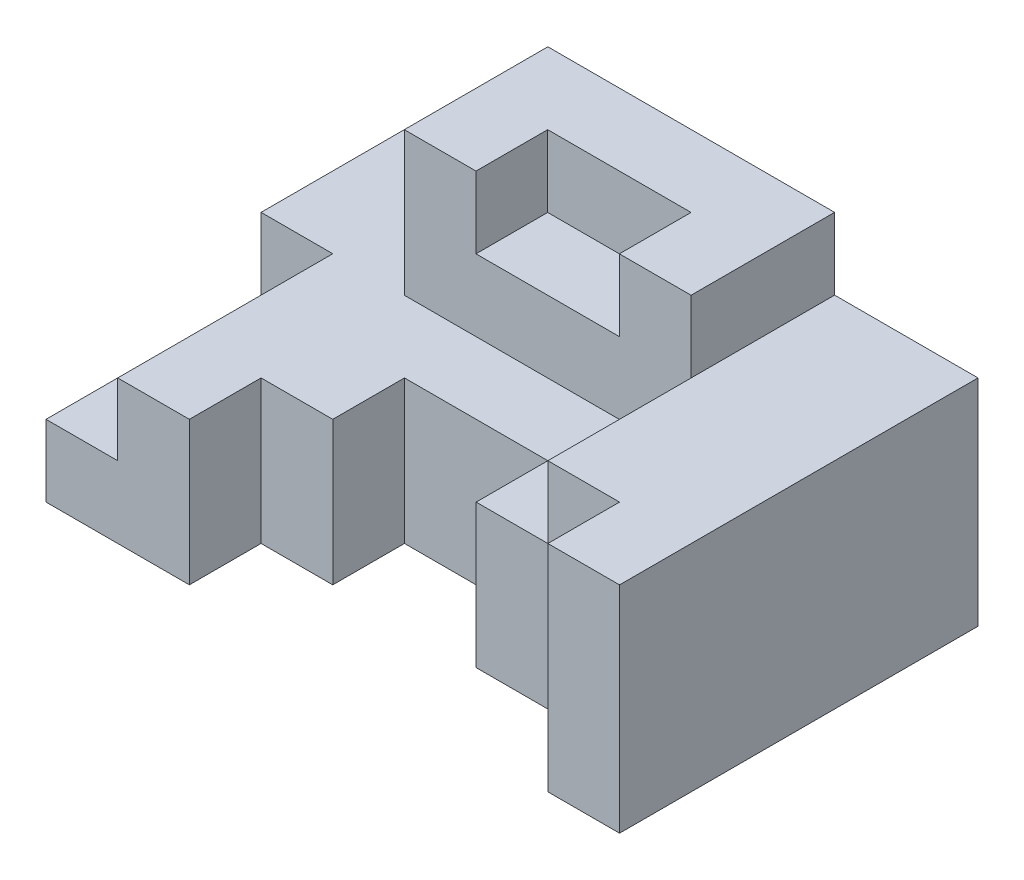
ISO-10303-21;
HEADER;
FILE_DESCRIPTION(('STEP AP214'),'2;1');
FILE_NAME('part.step','',(''),(''),'','','');
FILE_SCHEMA(('AUTOMOTIVE_DESIGN { 1 0 10303 214 1 1 1 1 }'));
ENDSEC;
DATA;
#1=APPLICATION_CONTEXT('core data for automotive mechanical design processes');
#2=APPLICATION_PROTOCOL_DEFINITION('international standard','automotive_design',2000,#1);
#3=PRODUCT_CONTEXT('',#1,'mechanical');
#4=PRODUCT('Part','Part','',(#3));
#5=PRODUCT_RELATED_PRODUCT_CATEGORY('part','',(#4));
#6=PRODUCT_DEFINITION_FORMATION('','',#4);
#7=PRODUCT_DEFINITION_CONTEXT('part definition',#1,'design');
#8=PRODUCT_DEFINITION('design','',#6,#7);
#9=PRODUCT_DEFINITION_SHAPE('','',#8);
#10=(LENGTH_UNIT() NAMED_UNIT(*) SI_UNIT(.MILLI.,.METRE.));
#11=(NAMED_UNIT(*) PLANE_ANGLE_UNIT() SI_UNIT($,.RADIAN.));
#12=(NAMED_UNIT(*) SI_UNIT($,.STERADIAN.) SOLID_ANGLE_UNIT());
#13=UNCERTAINTY_MEASURE_WITH_UNIT(LENGTH_MEASURE(1.E-05),#10,'distance_accuracy_value','');
#14=(GEOMETRIC_REPRESENTATION_CONTEXT(3) GLOBAL_UNCERTAINTY_ASSIGNED_CONTEXT((#13)) GLOBAL_UNIT_ASSIGNED_CONTEXT((#10,
#11,#12)) REPRESENTATION_CONTEXT('',''));
#15=CARTESIAN_POINT('',(0.,0.,0.));
#16=DIRECTION('',(0.,0.,1.));
#17=DIRECTION('',(1.,0.,0.));
#18=AXIS2_PLACEMENT_3D('',#15,#16,#17);
#19=CARTESIAN_POINT('',(0.,20.,0.));
#20=DIRECTION('',(0.,-1.,0.));
#21=DIRECTION('',(0.,0.,-1.));
#22=AXIS2_PLACEMENT_3D('',#19,#20,#21);
#23=PLANE('',#22);
#24=DIRECTION('',(0.,0.,1.));
#25=VECTOR('',#24,1.);
#26=CARTESIAN_POINT('',(-20.,20.,-25.));
#27=LINE('',#26,#25);
#28=CARTESIAN_POINT('',(-20.,20.,-25.));
#29=VERTEX_POINT('',#28);
#30=CARTESIAN_POINT('',(-20.,20.,-4.97728243811934));
#31=VERTEX_POINT('',#30);
#32=EDGE_CURVE('E237',#29,#31,#27,.T.);
#33=ORIENTED_EDGE('',*,*,#32,.F.);
#34=DIRECTION('',(-1.,0.,0.));
#35=VECTOR('',#34,1.);
#36=CARTESIAN_POINT('',(-40.,20.,-25.));
#37=LINE('',#36,#35);
#38=CARTESIAN_POINT('',(-40.,20.,-25.));
#39=VERTEX_POINT('',#38);
#40=EDGE_CURVE('E37',#29,#39,#37,.T.);
#41=ORIENTED_EDGE('',*,*,#40,.T.);
#42=DIRECTION('',(0.,0.,1.));
#43=VECTOR('',#42,1.);
#44=CARTESIAN_POINT('',(-40.,20.,25.));
#45=LINE('',#44,#43);
#46=CARTESIAN_POINT('',(-40.,20.,-4.99999999999999));
#47=VERTEX_POINT('',#46);
#48=EDGE_CURVE('E340',#39,#47,#45,.T.);
#49=ORIENTED_EDGE('',*,*,#48,.T.);
#50=DIRECTION('',(-1.,0.,0.));
#51=VECTOR('',#50,1.);
#52=CARTESIAN_POINT('',(-40.,20.,-4.99999999999999));
#53=LINE('',#52,#51);
#54=CARTESIAN_POINT('',(-30.,20.,-4.99999999999999));
#55=VERTEX_POINT('',#54);
#56=EDGE_CURVE('E387',#55,#47,#53,.T.);
#57=ORIENTED_EDGE('',*,*,#56,.F.);
#58=DIRECTION('',(0.,0.,-1.));
#59=VECTOR('',#58,1.);
#60=CARTESIAN_POINT('',(-30.,20.,25.));
#61=LINE('',#60,#59);
#62=CARTESIAN_POINT('',(-30.,20.,25.));
#63=VERTEX_POINT('',#62);
#64=EDGE_CURVE('E294',#63,#55,#61,.T.);
#65=ORIENTED_EDGE('',*,*,#64,.F.);
#66=DIRECTION('',(1.,0.,0.));
#67=VECTOR('',#66,1.);
#68=CARTESIAN_POINT('',(-40.,20.,25.));
#69=LINE('',#68,#67);
#70=CARTESIAN_POINT('',(-20.,20.,25.));
#71=VERTEX_POINT('',#70);
#72=EDGE_CURVE('E343',#63,#71,#69,.T.);
#73=ORIENTED_EDGE('',*,*,#72,.T.);
#74=DIRECTION('',(0.,0.,1.));
#75=VECTOR('',#74,1.);
#76=CARTESIAN_POINT('',(-20.,20.,25.));
#77=LINE('',#76,#75);
#78=CARTESIAN_POINT('',(-20.,20.,15.));
#79=VERTEX_POINT('',#78);
#80=EDGE_CURVE('E316',#79,#71,#77,.T.);
#81=ORIENTED_EDGE('',*,*,#80,.F.);
#82=DIRECTION('',(-1.,0.,0.));
#83=VECTOR('',#82,1.);
#84=CARTESIAN_POINT('',(-20.,20.,15.));
#85=LINE('',#84,#83);
#86=CARTESIAN_POINT('',(-10.,20.,15.));
#87=VERTEX_POINT('',#86);
#88=EDGE_CURVE('E313',#87,#79,#85,.T.);
#89=ORIENTED_EDGE('',*,*,#88,.F.);
#90=DIRECTION('',(0.,0.,1.));
#91=VECTOR('',#90,1.);
#92=CARTESIAN_POINT('',(-10.,20.,15.));
#93=LINE('',#92,#91);
#94=CARTESIAN_POINT('',(-10.,20.,5.));
#95=VERTEX_POINT('',#94);
#96=EDGE_CURVE('E310',#95,#87,#93,.T.);
#97=ORIENTED_EDGE('',*,*,#96,.F.);
#98=DIRECTION('',(-1.,0.,0.));
#99=VECTOR('',#98,1.);
#100=CARTESIAN_POINT('',(-10.,20.,5.));
#101=LINE('',#100,#99);
#102=CARTESIAN_POINT('',(10.,20.,5.));
#103=VERTEX_POINT('',#102);
#104=EDGE_CURVE('E307',#103,#95,#101,.T.);
#105=ORIENTED_EDGE('',*,*,#104,.F.);
#106=DIRECTION('',(0.,0.,-1.));
#107=VECTOR('',#106,1.);
#108=CARTESIAN_POINT('',(10.,20.,5.));
#109=LINE('',#108,#107);
#110=CARTESIAN_POINT('',(10.,20.,15.));
#111=VERTEX_POINT('',#110);
#112=EDGE_CURVE('E297',#111,#103,#109,.T.);
#113=ORIENTED_EDGE('',*,*,#112,.F.);
#114=DIRECTION('',(-1.,0.,0.));
#115=VECTOR('',#114,1.);
#116=CARTESIAN_POINT('',(10.,20.,15.));
#117=LINE('',#116,#115);
#118=CARTESIAN_POINT('',(20.,20.,15.));
#119=VERTEX_POINT('',#118);
#120=EDGE_CURVE('E295',#119,#111,#117,.T.);
#121=ORIENTED_EDGE('',*,*,#120,.F.);
#122=DIRECTION('',(0.,0.,1.));
#123=VECTOR('',#122,1.);
#124=CARTESIAN_POINT('',(20.,20.,-25.));
#125=LINE('',#124,#123);
#126=CARTESIAN_POINT('',(20.,20.,-4.97728243811935));
#127=VERTEX_POINT('',#126);
#128=EDGE_CURVE('E264',#127,#119,#125,.T.);
#129=ORIENTED_EDGE('',*,*,#128,.F.);
#130=DIRECTION('',(1.,0.,0.));
#131=VECTOR('',#130,1.);
#132=CARTESIAN_POINT('',(20.,20.,-4.97728243811935));
#133=LINE('',#132,#131);
#134=EDGE_CURVE('E245',#31,#127,#133,.T.);
#135=ORIENTED_EDGE('',*,*,#134,.F.);
#136=EDGE_LOOP('',(#33,#41,#49,#57,#65,#73,#81,#89,#97,#105,#113,#121,#129,#135));
#137=FACE_BOUND('',#136,.T.);
#138=ADVANCED_FACE('F33',(#137),#23,.F.);
#139=CARTESIAN_POINT('',(20.,30.,-25.));
#140=DIRECTION('',(1.,0.,0.));
#141=DIRECTION('',(0.,0.,-1.));
#142=AXIS2_PLACEMENT_3D('',#139,#140,#141);
#143=PLANE('',#142);
#144=DIRECTION('',(0.,-1.,0.));
#145=VECTOR('',#144,1.);
#146=CARTESIAN_POINT('',(20.,40.,-4.97728243811935));
#147=LINE('',#146,#145);
#148=CARTESIAN_POINT('',(20.,30.,-4.97728243811935));
#149=VERTEX_POINT('',#148);
#150=EDGE_CURVE('E252',#149,#127,#147,.T.);
#151=ORIENTED_EDGE('',*,*,#150,.T.);
#152=ORIENTED_EDGE('',*,*,#128,.T.);
#153=DIRECTION('',(0.,-1.,0.));
#154=VECTOR('',#153,1.);
#155=CARTESIAN_POINT('',(20.,30.,15.));
#156=LINE('',#155,#154);
#157=CARTESIAN_POINT('',(20.,30.,15.));
#158=VERTEX_POINT('',#157);
#159=EDGE_CURVE('E284',#158,#119,#156,.T.);
#160=ORIENTED_EDGE('',*,*,#159,.F.);
#161=DIRECTION('',(0.,0.,1.));
#162=VECTOR('',#161,1.);
#163=CARTESIAN_POINT('',(20.,30.,-25.));
#164=LINE('',#163,#162);
#165=EDGE_CURVE('E274',#149,#158,#164,.T.);
#166=ORIENTED_EDGE('',*,*,#165,.F.);
#167=EDGE_LOOP('',(#151,#152,#160,#166));
#168=FACE_BOUND('',#167,.T.);
#169=ADVANCED_FACE('F449',(#168),#143,.F.);
#170=CARTESIAN_POINT('',(-40.,20.,25.));
#171=DIRECTION('',(0.,0.,-1.));
#172=DIRECTION('',(-1.,0.,0.));
#173=AXIS2_PLACEMENT_3D('',#170,#171,#172);
#174=PLANE('',#173);
#175=ORIENTED_EDGE('',*,*,#72,.F.);
#176=DIRECTION('',(0.,1.,0.));
#177=VECTOR('',#176,1.);
#178=CARTESIAN_POINT('',(-30.,10.,25.));
#179=LINE('',#178,#177);
#180=CARTESIAN_POINT('',(-30.,10.,25.));
#181=VERTEX_POINT('',#180);
#182=EDGE_CURVE('E399',#181,#63,#179,.T.);
#183=ORIENTED_EDGE('',*,*,#182,.F.);
#184=DIRECTION('',(1.,0.,0.));
#185=VECTOR('',#184,1.);
#186=CARTESIAN_POINT('',(-40.,10.,25.));
#187=LINE('',#186,#185);
#188=CARTESIAN_POINT('',(-40.,10.,25.));
#189=VERTEX_POINT('',#188);
#190=EDGE_CURVE('E384',#189,#181,#187,.T.);
#191=ORIENTED_EDGE('',*,*,#190,.F.);
#192=DIRECTION('',(0.,-1.,0.));
#193=VECTOR('',#192,1.);
#194=CARTESIAN_POINT('',(-40.,20.,25.));
#195=LINE('',#194,#193);
#196=CARTESIAN_POINT('',(-40.,0.,25.));
#197=VERTEX_POINT('',#196);
#198=EDGE_CURVE('E359',#189,#197,#195,.T.);
#199=ORIENTED_EDGE('',*,*,#198,.T.);
#200=DIRECTION('',(1.,0.,0.));
#201=VECTOR('',#200,1.);
#202=CARTESIAN_POINT('',(-40.,0.,25.));
#203=LINE('',#202,#201);
#204=CARTESIAN_POINT('',(-20.,0.,25.));
#205=VERTEX_POINT('',#204);
#206=EDGE_CURVE('E354',#197,#205,#203,.T.);
#207=ORIENTED_EDGE('',*,*,#206,.T.);
#208=DIRECTION('',(0.,1.,0.));
#209=VECTOR('',#208,1.);
#210=CARTESIAN_POINT('',(-20.,0.,25.));
#211=LINE('',#210,#209);
#212=EDGE_CURVE('E320',#205,#71,#211,.T.);
#213=ORIENTED_EDGE('',*,*,#212,.T.);
#214=EDGE_LOOP('',(#175,#183,#191,#199,#207,#213));
#215=FACE_BOUND('',#214,.T.);
#216=ADVANCED_FACE('F380',(#215),#174,.F.);
#217=CARTESIAN_POINT('',(40.,20.,25.));
#218=DIRECTION('',(-1.,0.,0.));
#219=DIRECTION('',(0.,0.,1.));
#220=AXIS2_PLACEMENT_3D('',#217,#218,#219);
#221=PLANE('',#220);
#222=DIRECTION('',(0.,0.,-1.));
#223=VECTOR('',#222,1.);
#224=CARTESIAN_POINT('',(40.,0.,25.));
#225=LINE('',#224,#223);
#226=CARTESIAN_POINT('',(40.,0.,25.));
#227=VERTEX_POINT('',#226);
#228=CARTESIAN_POINT('',(40.,0.,-25.));
#229=VERTEX_POINT('',#228);
#230=EDGE_CURVE('E323',#227,#229,#225,.T.);
#231=ORIENTED_EDGE('',*,*,#230,.T.);
#232=DIRECTION('',(0.,-1.,0.));
#233=VECTOR('',#232,1.);
#234=CARTESIAN_POINT('',(40.,20.,-25.));
#235=LINE('',#234,#233);
#236=CARTESIAN_POINT('',(40.,30.,-25.));
#237=VERTEX_POINT('',#236);
#238=EDGE_CURVE('E11',#237,#229,#235,.T.);
#239=ORIENTED_EDGE('',*,*,#238,.F.);
#240=DIRECTION('',(0.,0.,-1.));
#241=VECTOR('',#240,1.);
#242=CARTESIAN_POINT('',(40.,30.,25.));
#243=LINE('',#242,#241);
#244=CARTESIAN_POINT('',(40.,30.,25.));
#245=VERTEX_POINT('',#244);
#246=EDGE_CURVE('E268',#245,#237,#243,.T.);
#247=ORIENTED_EDGE('',*,*,#246,.F.);
#248=DIRECTION('',(0.,-1.,0.));
#249=VECTOR('',#248,1.);
#250=CARTESIAN_POINT('',(40.,20.,25.));
#251=LINE('',#250,#249);
#252=EDGE_CURVE('E345',#245,#227,#251,.T.);
#253=ORIENTED_EDGE('',*,*,#252,.T.);
#254=EDGE_LOOP('',(#231,#239,#247,#253));
#255=FACE_BOUND('',#254,.T.);
#256=ADVANCED_FACE('F35',(#255),#221,.F.);
#257=CARTESIAN_POINT('',(-40.,20.,-25.));
#258=DIRECTION('',(0.,0.,1.));
#259=DIRECTION('',(1.,0.,0.));
#260=AXIS2_PLACEMENT_3D('',#257,#258,#259);
#261=PLANE('',#260);
#262=ORIENTED_EDGE('',*,*,#40,.F.);
#263=DIRECTION('',(0.,-1.,0.));
#264=VECTOR('',#263,1.);
#265=CARTESIAN_POINT('',(-20.,40.,-25.));
#266=LINE('',#265,#264);
#267=CARTESIAN_POINT('',(-20.,40.,-25.));
#268=VERTEX_POINT('',#267);
#269=EDGE_CURVE('E259',#268,#29,#266,.T.);
#270=ORIENTED_EDGE('',*,*,#269,.F.);
#271=DIRECTION('',(-1.,0.,0.));
#272=VECTOR('',#271,1.);
#273=CARTESIAN_POINT('',(20.,40.,-25.));
#274=LINE('',#273,#272);
#275=CARTESIAN_POINT('',(20.,40.,-25.));
#276=VERTEX_POINT('',#275);
#277=EDGE_CURVE('E244',#276,#268,#274,.T.);
#278=ORIENTED_EDGE('',*,*,#277,.F.);
#279=DIRECTION('',(0.,-1.,0.));
#280=VECTOR('',#279,1.);
#281=CARTESIAN_POINT('',(20.,40.,-25.));
#282=LINE('',#281,#280);
#283=CARTESIAN_POINT('',(20.,30.,-25.));
#284=VERTEX_POINT('',#283);
#285=EDGE_CURVE('E261',#276,#284,#282,.T.);
#286=ORIENTED_EDGE('',*,*,#285,.T.);
#287=DIRECTION('',(-1.,0.,0.));
#288=VECTOR('',#287,1.);
#289=CARTESIAN_POINT('',(40.,30.,-25.));
#290=LINE('',#289,#288);
#291=EDGE_CURVE('E271',#237,#284,#290,.T.);
#292=ORIENTED_EDGE('',*,*,#291,.F.);
#293=ORIENTED_EDGE('',*,*,#238,.T.);
#294=DIRECTION('',(-1.,0.,0.));
#295=VECTOR('',#294,1.);
#296=CARTESIAN_POINT('',(-40.,0.,-25.));
#297=LINE('',#296,#295);
#298=CARTESIAN_POINT('',(-40.,0.,-25.));
#299=VERTEX_POINT('',#298);
#300=EDGE_CURVE('E348',#229,#299,#297,.T.);
#301=ORIENTED_EDGE('',*,*,#300,.T.);
#302=DIRECTION('',(0.,-1.,0.));
#303=VECTOR('',#302,1.);
#304=CARTESIAN_POINT('',(-40.,20.,-25.));
#305=LINE('',#304,#303);
#306=EDGE_CURVE('E43',#39,#299,#305,.T.);
#307=ORIENTED_EDGE('',*,*,#306,.F.);
#308=EDGE_LOOP('',(#262,#270,#278,#286,#292,#293,#301,#307));
#309=FACE_BOUND('',#308,.T.);
#310=ADVANCED_FACE('F466',(#309),#261,.F.);
#311=CARTESIAN_POINT('',(-40.,20.,25.));
#312=DIRECTION('',(1.,0.,0.));
#313=DIRECTION('',(0.,0.,-1.));
#314=AXIS2_PLACEMENT_3D('',#311,#312,#313);
#315=PLANE('',#314);
#316=DIRECTION('',(0.,0.,1.));
#317=VECTOR('',#316,1.);
#318=CARTESIAN_POINT('',(-40.,10.,25.));
#319=LINE('',#318,#317);
#320=CARTESIAN_POINT('',(-40.,10.,-4.99999999999999));
#321=VERTEX_POINT('',#320);
#322=EDGE_CURVE('E287',#321,#189,#319,.T.);
#323=ORIENTED_EDGE('',*,*,#322,.F.);
#324=DIRECTION('',(0.,1.,0.));
#325=VECTOR('',#324,1.);
#326=CARTESIAN_POINT('',(-40.,10.,-4.99999999999999));
#327=LINE('',#326,#325);
#328=EDGE_CURVE('E298',#321,#47,#327,.T.);
#329=ORIENTED_EDGE('',*,*,#328,.T.);
#330=ORIENTED_EDGE('',*,*,#48,.F.);
#331=ORIENTED_EDGE('',*,*,#306,.T.);
#332=DIRECTION('',(0.,0.,1.));
#333=VECTOR('',#332,1.);
#334=CARTESIAN_POINT('',(-40.,0.,25.));
#335=LINE('',#334,#333);
#336=EDGE_CURVE('E350',#299,#197,#335,.T.);
#337=ORIENTED_EDGE('',*,*,#336,.T.);
#338=ORIENTED_EDGE('',*,*,#198,.F.);
#339=EDGE_LOOP('',(#323,#329,#330,#331,#337,#338));
#340=FACE_BOUND('',#339,.T.);
#341=ADVANCED_FACE('F366',(#340),#315,.F.);
#342=ORIENTED_EDGE('',*,*,#252,.F.);
#343=DIRECTION('',(1.,0.,0.));
#344=VECTOR('',#343,1.);
#345=CARTESIAN_POINT('',(30.,30.,25.));
#346=LINE('',#345,#344);
#347=CARTESIAN_POINT('',(30.,30.,25.));
#348=VERTEX_POINT('',#347);
#349=EDGE_CURVE('E265',#348,#245,#346,.T.);
#350=ORIENTED_EDGE('',*,*,#349,.F.);
#351=DIRECTION('',(0.,1.,0.));
#352=VECTOR('',#351,1.);
#353=CARTESIAN_POINT('',(30.,0.,25.));
#354=LINE('',#353,#352);
#355=CARTESIAN_POINT('',(30.,0.,25.));
#356=VERTEX_POINT('',#355);
#357=EDGE_CURVE('E337',#356,#348,#354,.T.);
#358=ORIENTED_EDGE('',*,*,#357,.F.);
#359=EDGE_CURVE('E353',#356,#227,#203,.T.);
#360=ORIENTED_EDGE('',*,*,#359,.T.);
#361=EDGE_LOOP('',(#342,#350,#358,#360));
#362=FACE_BOUND('',#361,.T.);
#363=ADVANCED_FACE('F461',(#362),#174,.F.);
#364=CARTESIAN_POINT('',(0.,0.,0.));
#365=DIRECTION('',(0.,-1.,0.));
#366=DIRECTION('',(0.,0.,-1.));
#367=AXIS2_PLACEMENT_3D('',#364,#365,#366);
#368=PLANE('',#367);
#369=DIRECTION('',(0.,0.,1.));
#370=VECTOR('',#369,1.);
#371=CARTESIAN_POINT('',(-20.,0.,25.));
#372=LINE('',#371,#370);
#373=CARTESIAN_POINT('',(-20.,0.,15.));
#374=VERTEX_POINT('',#373);
#375=EDGE_CURVE('E303',#374,#205,#372,.T.);
#376=ORIENTED_EDGE('',*,*,#375,.T.);
#377=ORIENTED_EDGE('',*,*,#206,.F.);
#378=ORIENTED_EDGE('',*,*,#336,.F.);
#379=ORIENTED_EDGE('',*,*,#300,.F.);
#380=ORIENTED_EDGE('',*,*,#230,.F.);
#381=ORIENTED_EDGE('',*,*,#359,.F.);
#382=DIRECTION('',(0.,0.,-1.));
#383=VECTOR('',#382,1.);
#384=CARTESIAN_POINT('',(30.,0.,15.));
#385=LINE('',#384,#383);
#386=CARTESIAN_POINT('',(30.,0.,15.));
#387=VERTEX_POINT('',#386);
#388=EDGE_CURVE('E319',#356,#387,#385,.T.);
#389=ORIENTED_EDGE('',*,*,#388,.T.);
#390=DIRECTION('',(-1.,0.,0.));
#391=VECTOR('',#390,1.);
#392=CARTESIAN_POINT('',(10.,0.,15.));
#393=LINE('',#392,#391);
#394=CARTESIAN_POINT('',(10.,0.,15.));
#395=VERTEX_POINT('',#394);
#396=EDGE_CURVE('E404',#387,#395,#393,.T.);
#397=ORIENTED_EDGE('',*,*,#396,.T.);
#398=DIRECTION('',(0.,0.,-1.));
#399=VECTOR('',#398,1.);
#400=CARTESIAN_POINT('',(10.,0.,5.));
#401=LINE('',#400,#399);
#402=CARTESIAN_POINT('',(10.,0.,5.));
#403=VERTEX_POINT('',#402);
#404=EDGE_CURVE('E407',#395,#403,#401,.T.);
#405=ORIENTED_EDGE('',*,*,#404,.T.);
#406=DIRECTION('',(-1.,0.,0.));
#407=VECTOR('',#406,1.);
#408=CARTESIAN_POINT('',(-10.,0.,5.));
#409=LINE('',#408,#407);
#410=CARTESIAN_POINT('',(-10.,0.,5.));
#411=VERTEX_POINT('',#410);
#412=EDGE_CURVE('E410',#403,#411,#409,.T.);
#413=ORIENTED_EDGE('',*,*,#412,.T.);
#414=DIRECTION('',(0.,0.,1.));
#415=VECTOR('',#414,1.);
#416=CARTESIAN_POINT('',(-10.,0.,15.));
#417=LINE('',#416,#415);
#418=CARTESIAN_POINT('',(-10.,0.,15.));
#419=VERTEX_POINT('',#418);
#420=EDGE_CURVE('E413',#411,#419,#417,.T.);
#421=ORIENTED_EDGE('',*,*,#420,.T.);
#422=DIRECTION('',(-1.,0.,0.));
#423=VECTOR('',#422,1.);
#424=CARTESIAN_POINT('',(-20.,0.,15.));
#425=LINE('',#424,#423);
#426=EDGE_CURVE('E415',#419,#374,#425,.T.);
#427=ORIENTED_EDGE('',*,*,#426,.T.);
#428=EDGE_LOOP('',(#376,#377,#378,#379,#380,#381,#389,#397,#405,#413,#421,#427));
#429=FACE_BOUND('',#428,.T.);
#430=ADVANCED_FACE('F374',(#429),#368,.T.);
#431=CARTESIAN_POINT('',(-20.,0.,25.));
#432=DIRECTION('',(-1.,0.,0.));
#433=DIRECTION('',(0.,0.,1.));
#434=AXIS2_PLACEMENT_3D('',#431,#432,#433);
#435=PLANE('',#434);
#436=ORIENTED_EDGE('',*,*,#80,.T.);
#437=ORIENTED_EDGE('',*,*,#212,.F.);
#438=ORIENTED_EDGE('',*,*,#375,.F.);
#439=DIRECTION('',(0.,1.,0.));
#440=VECTOR('',#439,1.);
#441=CARTESIAN_POINT('',(-20.,0.,15.));
#442=LINE('',#441,#440);
#443=EDGE_CURVE('E324',#374,#79,#442,.T.);
#444=ORIENTED_EDGE('',*,*,#443,.T.);
#445=EDGE_LOOP('',(#436,#437,#438,#444));
#446=FACE_BOUND('',#445,.T.);
#447=ADVANCED_FACE('F423',(#446),#435,.F.);
#448=CARTESIAN_POINT('',(-20.,0.,15.));
#449=DIRECTION('',(0.,0.,-1.));
#450=DIRECTION('',(-1.,0.,0.));
#451=AXIS2_PLACEMENT_3D('',#448,#449,#450);
#452=PLANE('',#451);
#453=ORIENTED_EDGE('',*,*,#88,.T.);
#454=ORIENTED_EDGE('',*,*,#443,.F.);
#455=ORIENTED_EDGE('',*,*,#426,.F.);
#456=DIRECTION('',(0.,1.,0.));
#457=VECTOR('',#456,1.);
#458=CARTESIAN_POINT('',(-10.,0.,15.));
#459=LINE('',#458,#457);
#460=EDGE_CURVE('E326',#419,#87,#459,.T.);
#461=ORIENTED_EDGE('',*,*,#460,.T.);
#462=EDGE_LOOP('',(#453,#454,#455,#461));
#463=FACE_BOUND('',#462,.T.);
#464=ADVANCED_FACE('F419',(#463),#452,.F.);
#465=CARTESIAN_POINT('',(-10.,0.,15.));
#466=DIRECTION('',(-1.,0.,0.));
#467=DIRECTION('',(0.,0.,1.));
#468=AXIS2_PLACEMENT_3D('',#465,#466,#467);
#469=PLANE('',#468);
#470=ORIENTED_EDGE('',*,*,#96,.T.);
#471=ORIENTED_EDGE('',*,*,#460,.F.);
#472=ORIENTED_EDGE('',*,*,#420,.F.);
#473=DIRECTION('',(0.,1.,0.));
#474=VECTOR('',#473,1.);
#475=CARTESIAN_POINT('',(-10.,0.,5.));
#476=LINE('',#475,#474);
#477=EDGE_CURVE('E328',#411,#95,#476,.T.);
#478=ORIENTED_EDGE('',*,*,#477,.T.);
#479=EDGE_LOOP('',(#470,#471,#472,#478));
#480=FACE_BOUND('',#479,.T.);
#481=ADVANCED_FACE('F506',(#480),#469,.F.);
#482=CARTESIAN_POINT('',(-10.,0.,5.));
#483=DIRECTION('',(0.,0.,-1.));
#484=DIRECTION('',(-1.,0.,0.));
#485=AXIS2_PLACEMENT_3D('',#482,#483,#484);
#486=PLANE('',#485);
#487=ORIENTED_EDGE('',*,*,#104,.T.);
#488=ORIENTED_EDGE('',*,*,#477,.F.);
#489=ORIENTED_EDGE('',*,*,#412,.F.);
#490=DIRECTION('',(0.,1.,0.));
#491=VECTOR('',#490,1.);
#492=CARTESIAN_POINT('',(10.,0.,5.));
#493=LINE('',#492,#491);
#494=EDGE_CURVE('E330',#403,#103,#493,.T.);
#495=ORIENTED_EDGE('',*,*,#494,.T.);
#496=EDGE_LOOP('',(#487,#488,#489,#495));
#497=FACE_BOUND('',#496,.T.);
#498=ADVANCED_FACE('F504',(#497),#486,.F.);
#499=CARTESIAN_POINT('',(10.,0.,5.));
#500=DIRECTION('',(1.,0.,0.));
#501=DIRECTION('',(0.,0.,-1.));
#502=AXIS2_PLACEMENT_3D('',#499,#500,#501);
#503=PLANE('',#502);
#504=ORIENTED_EDGE('',*,*,#112,.T.);
#505=ORIENTED_EDGE('',*,*,#494,.F.);
#506=ORIENTED_EDGE('',*,*,#404,.F.);
#507=DIRECTION('',(0.,1.,0.));
#508=VECTOR('',#507,1.);
#509=CARTESIAN_POINT('',(10.,0.,15.));
#510=LINE('',#509,#508);
#511=EDGE_CURVE('E332',#395,#111,#510,.T.);
#512=ORIENTED_EDGE('',*,*,#511,.T.);
#513=EDGE_LOOP('',(#504,#505,#506,#512));
#514=FACE_BOUND('',#513,.T.);
#515=ADVANCED_FACE('F500',(#514),#503,.F.);
#516=CARTESIAN_POINT('',(10.,0.,15.));
#517=DIRECTION('',(0.,0.,-1.));
#518=DIRECTION('',(-1.,0.,0.));
#519=AXIS2_PLACEMENT_3D('',#516,#517,#518);
#520=PLANE('',#519);
#521=DIRECTION('',(0.,1.,0.));
#522=VECTOR('',#521,1.);
#523=CARTESIAN_POINT('',(30.,0.,15.));
#524=LINE('',#523,#522);
#525=CARTESIAN_POINT('',(30.,30.,15.));
#526=VERTEX_POINT('',#525);
#527=EDGE_CURVE('E335',#387,#526,#524,.T.);
#528=ORIENTED_EDGE('',*,*,#527,.T.);
#529=DIRECTION('',(1.,0.,0.));
#530=VECTOR('',#529,1.);
#531=CARTESIAN_POINT('',(20.,30.,15.));
#532=LINE('',#531,#530);
#533=EDGE_CURVE('E278',#158,#526,#532,.T.);
#534=ORIENTED_EDGE('',*,*,#533,.F.);
#535=ORIENTED_EDGE('',*,*,#159,.T.);
#536=ORIENTED_EDGE('',*,*,#120,.T.);
#537=ORIENTED_EDGE('',*,*,#511,.F.);
#538=ORIENTED_EDGE('',*,*,#396,.F.);
#539=EDGE_LOOP('',(#528,#534,#535,#536,#537,#538));
#540=FACE_BOUND('',#539,.T.);
#541=ADVANCED_FACE('F496',(#540),#520,.F.);
#542=CARTESIAN_POINT('',(30.,0.,15.));
#543=DIRECTION('',(1.,0.,0.));
#544=DIRECTION('',(0.,0.,-1.));
#545=AXIS2_PLACEMENT_3D('',#542,#543,#544);
#546=PLANE('',#545);
#547=ORIENTED_EDGE('',*,*,#357,.T.);
#548=DIRECTION('',(0.,0.,1.));
#549=VECTOR('',#548,1.);
#550=CARTESIAN_POINT('',(30.,30.,15.));
#551=LINE('',#550,#549);
#552=EDGE_CURVE('E281',#526,#348,#551,.T.);
#553=ORIENTED_EDGE('',*,*,#552,.F.);
#554=ORIENTED_EDGE('',*,*,#527,.F.);
#555=ORIENTED_EDGE('',*,*,#388,.F.);
#556=EDGE_LOOP('',(#547,#553,#554,#555));
#557=FACE_BOUND('',#556,.T.);
#558=ADVANCED_FACE('F457',(#557),#546,.F.);
#559=CARTESIAN_POINT('',(-40.,10.,-4.99999999999999));
#560=DIRECTION('',(0.,0.,-1.));
#561=DIRECTION('',(-1.,0.,0.));
#562=AXIS2_PLACEMENT_3D('',#559,#560,#561);
#563=PLANE('',#562);
#564=ORIENTED_EDGE('',*,*,#56,.T.);
#565=ORIENTED_EDGE('',*,*,#328,.F.);
#566=DIRECTION('',(-1.,0.,0.));
#567=VECTOR('',#566,1.);
#568=CARTESIAN_POINT('',(-40.,10.,-4.99999999999999));
#569=LINE('',#568,#567);
#570=CARTESIAN_POINT('',(-30.,10.,-4.99999999999999));
#571=VERTEX_POINT('',#570);
#572=EDGE_CURVE('E401',#571,#321,#569,.T.);
#573=ORIENTED_EDGE('',*,*,#572,.F.);
#574=DIRECTION('',(0.,1.,0.));
#575=VECTOR('',#574,1.);
#576=CARTESIAN_POINT('',(-30.,10.,-4.99999999999999));
#577=LINE('',#576,#575);
#578=EDGE_CURVE('E397',#571,#55,#577,.T.);
#579=ORIENTED_EDGE('',*,*,#578,.T.);
#580=EDGE_LOOP('',(#564,#565,#573,#579));
#581=FACE_BOUND('',#580,.T.);
#582=ADVANCED_FACE('F444',(#581),#563,.F.);
#583=CARTESIAN_POINT('',(-30.,10.,25.));
#584=DIRECTION('',(1.,0.,0.));
#585=DIRECTION('',(0.,0.,-1.));
#586=AXIS2_PLACEMENT_3D('',#583,#584,#585);
#587=PLANE('',#586);
#588=ORIENTED_EDGE('',*,*,#64,.T.);
#589=ORIENTED_EDGE('',*,*,#578,.F.);
#590=DIRECTION('',(0.,0.,-1.));
#591=VECTOR('',#590,1.);
#592=CARTESIAN_POINT('',(-30.,10.,25.));
#593=LINE('',#592,#591);
#594=EDGE_CURVE('E388',#181,#571,#593,.T.);
#595=ORIENTED_EDGE('',*,*,#594,.F.);
#596=ORIENTED_EDGE('',*,*,#182,.T.);
#597=EDGE_LOOP('',(#588,#589,#595,#596));
#598=FACE_BOUND('',#597,.T.);
#599=ADVANCED_FACE('F429',(#598),#587,.F.);
#600=CARTESIAN_POINT('',(0.,10.,0.));
#601=DIRECTION('',(0.,-1.,0.));
#602=DIRECTION('',(0.,0.,-1.));
#603=AXIS2_PLACEMENT_3D('',#600,#601,#602);
#604=PLANE('',#603);
#605=ORIENTED_EDGE('',*,*,#322,.T.);
#606=ORIENTED_EDGE('',*,*,#190,.T.);
#607=ORIENTED_EDGE('',*,*,#594,.T.);
#608=ORIENTED_EDGE('',*,*,#572,.T.);
#609=EDGE_LOOP('',(#605,#606,#607,#608));
#610=FACE_BOUND('',#609,.T.);
#611=ADVANCED_FACE('F433',(#610),#604,.F.);
#612=CARTESIAN_POINT('',(0.,30.,0.));
#613=DIRECTION('',(0.,1.,0.));
#614=DIRECTION('',(0.,0.,1.));
#615=AXIS2_PLACEMENT_3D('',#612,#613,#614);
#616=PLANE('',#615);
#617=ORIENTED_EDGE('',*,*,#349,.T.);
#618=ORIENTED_EDGE('',*,*,#246,.T.);
#619=ORIENTED_EDGE('',*,*,#291,.T.);
#620=EDGE_CURVE('E275',#284,#149,#164,.T.);
#621=ORIENTED_EDGE('',*,*,#620,.T.);
#622=ORIENTED_EDGE('',*,*,#165,.T.);
#623=ORIENTED_EDGE('',*,*,#533,.T.);
#624=ORIENTED_EDGE('',*,*,#552,.T.);
#625=EDGE_LOOP('',(#617,#618,#619,#621,#622,#623,#624));
#626=FACE_BOUND('',#625,.T.);
#627=ADVANCED_FACE('F435',(#626),#616,.T.);
#628=CARTESIAN_POINT('',(20.,40.,-25.));
#629=DIRECTION('',(-1.,0.,0.));
#630=DIRECTION('',(0.,0.,1.));
#631=AXIS2_PLACEMENT_3D('',#628,#629,#630);
#632=PLANE('',#631);
#633=ORIENTED_EDGE('',*,*,#620,.F.);
#634=ORIENTED_EDGE('',*,*,#285,.F.);
#635=DIRECTION('',(0.,0.,-1.));
#636=VECTOR('',#635,1.);
#637=CARTESIAN_POINT('',(20.,40.,-25.));
#638=LINE('',#637,#636);
#639=CARTESIAN_POINT('',(20.,40.,-4.97728243811935));
#640=VERTEX_POINT('',#639);
#641=EDGE_CURVE('E241',#640,#276,#638,.T.);
#642=ORIENTED_EDGE('',*,*,#641,.F.);
#643=EDGE_CURVE('E59',#640,#149,#147,.T.);
#644=ORIENTED_EDGE('',*,*,#643,.T.);
#645=EDGE_LOOP('',(#633,#634,#642,#644));
#646=FACE_BOUND('',#645,.T.);
#647=ADVANCED_FACE('F441',(#646),#632,.F.);
#648=CARTESIAN_POINT('',(-20.,40.,-25.));
#649=DIRECTION('',(1.,0.,0.));
#650=DIRECTION('',(0.,0.,-1.));
#651=AXIS2_PLACEMENT_3D('',#648,#649,#650);
#652=PLANE('',#651);
#653=ORIENTED_EDGE('',*,*,#32,.T.);
#654=DIRECTION('',(0.,-1.,0.));
#655=VECTOR('',#654,1.);
#656=CARTESIAN_POINT('',(-20.,40.,-4.97728243811934));
#657=LINE('',#656,#655);
#658=CARTESIAN_POINT('',(-20.,40.,-4.97728243811934));
#659=VERTEX_POINT('',#658);
#660=EDGE_CURVE('E256',#659,#31,#657,.T.);
#661=ORIENTED_EDGE('',*,*,#660,.F.);
#662=DIRECTION('',(0.,0.,1.));
#663=VECTOR('',#662,1.);
#664=CARTESIAN_POINT('',(-20.,40.,-25.));
#665=LINE('',#664,#663);
#666=EDGE_CURVE('E247',#268,#659,#665,.T.);
#667=ORIENTED_EDGE('',*,*,#666,.F.);
#668=ORIENTED_EDGE('',*,*,#269,.T.);
#669=EDGE_LOOP('',(#653,#661,#667,#668));
#670=FACE_BOUND('',#669,.T.);
#671=ADVANCED_FACE('F478',(#670),#652,.F.);
#672=CARTESIAN_POINT('',(20.,40.,-4.97728243811935));
#673=DIRECTION('',(0.,0.,-1.));
#674=DIRECTION('',(-1.,0.,0.));
#675=AXIS2_PLACEMENT_3D('',#672,#673,#674);
#676=PLANE('',#675);
#677=DIRECTION('',(1.,0.,0.));
#678=VECTOR('',#677,1.);
#679=CARTESIAN_POINT('',(-10.,30.,-4.97728243811934));
#680=LINE('',#679,#678);
#681=CARTESIAN_POINT('',(-10.,30.,-4.97728243811934));
#682=VERTEX_POINT('',#681);
#683=CARTESIAN_POINT('',(9.99999999999999,30.,-4.97728243811934));
#684=VERTEX_POINT('',#683);
#685=EDGE_CURVE('E219',#682,#684,#680,.T.);
#686=ORIENTED_EDGE('',*,*,#685,.F.);
#687=DIRECTION('',(0.,1.,0.));
#688=VECTOR('',#687,1.);
#689=CARTESIAN_POINT('',(-10.,30.,-4.97728243811934));
#690=LINE('',#689,#688);
#691=CARTESIAN_POINT('',(-10.,40.,-4.97728243811934));
#692=VERTEX_POINT('',#691);
#693=EDGE_CURVE('E202',#682,#692,#690,.T.);
#694=ORIENTED_EDGE('',*,*,#693,.T.);
#695=DIRECTION('',(1.,0.,0.));
#696=VECTOR('',#695,1.);
#697=CARTESIAN_POINT('',(20.,40.,-4.97728243811935));
#698=LINE('',#697,#696);
#699=EDGE_CURVE('E250',#659,#692,#698,.T.);
#700=ORIENTED_EDGE('',*,*,#699,.F.);
#701=ORIENTED_EDGE('',*,*,#660,.T.);
#702=ORIENTED_EDGE('',*,*,#134,.T.);
#703=ORIENTED_EDGE('',*,*,#150,.F.);
#704=ORIENTED_EDGE('',*,*,#643,.F.);
#705=CARTESIAN_POINT('',(9.99999999999999,40.,-4.97728243811934));
#706=VERTEX_POINT('',#705);
#707=EDGE_CURVE('E249',#706,#640,#698,.T.);
#708=ORIENTED_EDGE('',*,*,#707,.F.);
#709=DIRECTION('',(0.,1.,0.));
#710=VECTOR('',#709,1.);
#711=CARTESIAN_POINT('',(9.99999999999999,30.,-4.97728243811934));
#712=LINE('',#711,#710);
#713=EDGE_CURVE('E51',#684,#706,#712,.T.);
#714=ORIENTED_EDGE('',*,*,#713,.F.);
#715=EDGE_LOOP('',(#686,#694,#700,#701,#702,#703,#704,#708,#714));
#716=FACE_BOUND('',#715,.T.);
#717=ADVANCED_FACE('F223',(#716),#676,.F.);
#718=CARTESIAN_POINT('',(0.,40.,0.));
#719=DIRECTION('',(0.,-1.,0.));
#720=DIRECTION('',(0.,0.,-1.));
#721=AXIS2_PLACEMENT_3D('',#718,#719,#720);
#722=PLANE('',#721);
#723=ORIENTED_EDGE('',*,*,#699,.T.);
#724=DIRECTION('',(0.,0.,1.));
#725=VECTOR('',#724,1.);
#726=CARTESIAN_POINT('',(-10.,40.,-4.97728243811934));
#727=LINE('',#726,#725);
#728=CARTESIAN_POINT('',(-10.,40.,-14.9772824381193));
#729=VERTEX_POINT('',#728);
#730=EDGE_CURVE('E208',#729,#692,#727,.T.);
#731=ORIENTED_EDGE('',*,*,#730,.F.);
#732=DIRECTION('',(-1.,0.,0.));
#733=VECTOR('',#732,1.);
#734=CARTESIAN_POINT('',(-10.,40.,-14.9772824381193));
#735=LINE('',#734,#733);
#736=CARTESIAN_POINT('',(10.,40.,-14.9772824381193));
#737=VERTEX_POINT('',#736);
#738=EDGE_CURVE('E221',#737,#729,#735,.T.);
#739=ORIENTED_EDGE('',*,*,#738,.F.);
#740=DIRECTION('',(0.,0.,-1.));
#741=VECTOR('',#740,1.);
#742=CARTESIAN_POINT('',(9.99999999999999,40.,-4.97728243811934));
#743=LINE('',#742,#741);
#744=EDGE_CURVE('E231',#706,#737,#743,.T.);
#745=ORIENTED_EDGE('',*,*,#744,.F.);
#746=ORIENTED_EDGE('',*,*,#707,.T.);
#747=ORIENTED_EDGE('',*,*,#641,.T.);
#748=ORIENTED_EDGE('',*,*,#277,.T.);
#749=ORIENTED_EDGE('',*,*,#666,.T.);
#750=EDGE_LOOP('',(#723,#731,#739,#745,#746,#747,#748,#749));
#751=FACE_BOUND('',#750,.T.);
#752=ADVANCED_FACE('F481',(#751),#722,.F.);
#753=CARTESIAN_POINT('',(-10.,30.,-4.97728243811934));
#754=DIRECTION('',(-1.,0.,0.));
#755=DIRECTION('',(0.,0.,1.));
#756=AXIS2_PLACEMENT_3D('',#753,#754,#755);
#757=PLANE('',#756);
#758=ORIENTED_EDGE('',*,*,#730,.T.);
#759=ORIENTED_EDGE('',*,*,#693,.F.);
#760=DIRECTION('',(0.,0.,1.));
#761=VECTOR('',#760,1.);
#762=CARTESIAN_POINT('',(-10.,30.,-4.97728243811934));
#763=LINE('',#762,#761);
#764=CARTESIAN_POINT('',(-10.,30.,-14.9772824381193));
#765=VERTEX_POINT('',#764);
#766=EDGE_CURVE('E205',#765,#682,#763,.T.);
#767=ORIENTED_EDGE('',*,*,#766,.F.);
#768=DIRECTION('',(0.,1.,0.));
#769=VECTOR('',#768,1.);
#770=CARTESIAN_POINT('',(-10.,30.,-14.9772824381193));
#771=LINE('',#770,#769);
#772=EDGE_CURVE('E235',#765,#729,#771,.T.);
#773=ORIENTED_EDGE('',*,*,#772,.T.);
#774=EDGE_LOOP('',(#758,#759,#767,#773));
#775=FACE_BOUND('',#774,.T.);
#776=ADVANCED_FACE('F204',(#775),#757,.F.);
#777=CARTESIAN_POINT('',(-10.,30.,-14.9772824381193));
#778=DIRECTION('',(0.,0.,-1.));
#779=DIRECTION('',(-1.,0.,0.));
#780=AXIS2_PLACEMENT_3D('',#777,#778,#779);
#781=PLANE('',#780);
#782=ORIENTED_EDGE('',*,*,#738,.T.);
#783=ORIENTED_EDGE('',*,*,#772,.F.);
#784=DIRECTION('',(-1.,0.,0.));
#785=VECTOR('',#784,1.);
#786=CARTESIAN_POINT('',(-10.,30.,-14.9772824381193));
#787=LINE('',#786,#785);
#788=CARTESIAN_POINT('',(10.,30.,-14.9772824381193));
#789=VERTEX_POINT('',#788);
#790=EDGE_CURVE('E213',#789,#765,#787,.T.);
#791=ORIENTED_EDGE('',*,*,#790,.F.);
#792=DIRECTION('',(0.,1.,0.));
#793=VECTOR('',#792,1.);
#794=CARTESIAN_POINT('',(10.,30.,-14.9772824381193));
#795=LINE('',#794,#793);
#796=EDGE_CURVE('E238',#789,#737,#795,.T.);
#797=ORIENTED_EDGE('',*,*,#796,.T.);
#798=EDGE_LOOP('',(#782,#783,#791,#797));
#799=FACE_BOUND('',#798,.T.);
#800=ADVANCED_FACE('F521',(#799),#781,.F.);
#801=CARTESIAN_POINT('',(9.99999999999999,30.,-4.97728243811934));
#802=DIRECTION('',(1.,0.,0.));
#803=DIRECTION('',(0.,0.,-1.));
#804=AXIS2_PLACEMENT_3D('',#801,#802,#803);
#805=PLANE('',#804);
#806=ORIENTED_EDGE('',*,*,#744,.T.);
#807=ORIENTED_EDGE('',*,*,#796,.F.);
#808=DIRECTION('',(0.,0.,-1.));
#809=VECTOR('',#808,1.);
#810=CARTESIAN_POINT('',(9.99999999999999,30.,-4.97728243811934));
#811=LINE('',#810,#809);
#812=EDGE_CURVE('E225',#684,#789,#811,.T.);
#813=ORIENTED_EDGE('',*,*,#812,.F.);
#814=ORIENTED_EDGE('',*,*,#713,.T.);
#815=EDGE_LOOP('',(#806,#807,#813,#814));
#816=FACE_BOUND('',#815,.T.);
#817=ADVANCED_FACE('F522',(#816),#805,.F.);
#818=CARTESIAN_POINT('',(0.,30.,0.));
#819=DIRECTION('',(0.,-1.,0.));
#820=DIRECTION('',(0.,0.,-1.));
#821=AXIS2_PLACEMENT_3D('',#818,#819,#820);
#822=PLANE('',#821);
#823=ORIENTED_EDGE('',*,*,#766,.T.);
#824=ORIENTED_EDGE('',*,*,#685,.T.);
#825=ORIENTED_EDGE('',*,*,#812,.T.);
#826=ORIENTED_EDGE('',*,*,#790,.T.);
#827=EDGE_LOOP('',(#823,#824,#825,#826));
#828=FACE_BOUND('',#827,.T.);
#829=ADVANCED_FACE('F217',(#828),#822,.F.);
#830=CLOSED_SHELL('',(#138,#169,#216,#256,#310,#341,#363,#430,#447,#464,#481,#498,#515,#541,
#558,#582,#599,#611,#627,#647,#671,#717,#752,#776,#800,#817,#829));
#831=MANIFOLD_SOLID_BREP('B2',#830);
#832=ADVANCED_BREP_SHAPE_REPRESENTATION('',(#18,#831),#14);
#833=SHAPE_DEFINITION_REPRESENTATION(#9,#832);
ENDSEC;
END-ISO-10303-21;
